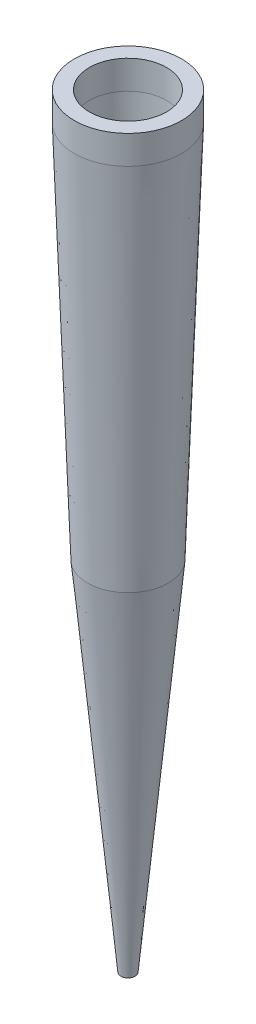
ISO-10303-21;
HEADER;
FILE_DESCRIPTION(('STEP AP214'),'2;1');
FILE_NAME('part.step','',(''),(''),'','','');
FILE_SCHEMA(('AUTOMOTIVE_DESIGN { 1 0 10303 214 1 1 1 1 }'));
ENDSEC;
DATA;
#1=APPLICATION_CONTEXT('core data for automotive mechanical design processes');
#2=APPLICATION_PROTOCOL_DEFINITION('international standard','automotive_design',2000,#1);
#3=PRODUCT_CONTEXT('',#1,'mechanical');
#4=PRODUCT('Part','Part','',(#3));
#5=PRODUCT_RELATED_PRODUCT_CATEGORY('part','',(#4));
#6=PRODUCT_DEFINITION_FORMATION('','',#4);
#7=PRODUCT_DEFINITION_CONTEXT('part definition',#1,'design');
#8=PRODUCT_DEFINITION('design','',#6,#7);
#9=PRODUCT_DEFINITION_SHAPE('','',#8);
#10=(LENGTH_UNIT() NAMED_UNIT(*) SI_UNIT(.MILLI.,.METRE.));
#11=(NAMED_UNIT(*) PLANE_ANGLE_UNIT() SI_UNIT($,.RADIAN.));
#12=(NAMED_UNIT(*) SI_UNIT($,.STERADIAN.) SOLID_ANGLE_UNIT());
#13=UNCERTAINTY_MEASURE_WITH_UNIT(LENGTH_MEASURE(1.E-05),#10,'distance_accuracy_value','');
#14=(GEOMETRIC_REPRESENTATION_CONTEXT(3) GLOBAL_UNCERTAINTY_ASSIGNED_CONTEXT((#13)) GLOBAL_UNIT_ASSIGNED_CONTEXT((#10,
#11,#12)) REPRESENTATION_CONTEXT('',''));
#15=CARTESIAN_POINT('',(0.,0.,0.));
#16=DIRECTION('',(0.,0.,1.));
#17=DIRECTION('',(1.,0.,0.));
#18=AXIS2_PLACEMENT_3D('',#15,#16,#17);
#19=CARTESIAN_POINT('',(-3.75,0.,0.));
#20=DIRECTION('',(0.,1.,0.));
#21=DIRECTION('',(-1.,0.,0.));
#22=AXIS2_PLACEMENT_3D('',#19,#20,#21);
#23=PLANE('',#22);
#24=CARTESIAN_POINT('',(0.,0.,0.));
#25=DIRECTION('',(0.,1.,0.));
#26=DIRECTION('',(-1.,0.,0.));
#27=AXIS2_PLACEMENT_3D('',#24,#25,#26);
#28=CIRCLE('',#27,3.75);
#29=CARTESIAN_POINT('',(-3.75,0.,0.));
#30=VERTEX_POINT('',#29);
#31=EDGE_CURVE('E64',#30,#30,#28,.T.);
#32=ORIENTED_EDGE('',*,*,#31,.T.);
#33=EDGE_LOOP('',(#32));
#34=FACE_BOUND('',#33,.T.);
#35=CARTESIAN_POINT('',(0.,0.,0.));
#36=DIRECTION('',(0.,1.,0.));
#37=DIRECTION('',(-1.,0.,0.));
#38=AXIS2_PLACEMENT_3D('',#35,#36,#37);
#39=CIRCLE('',#38,2.7);
#40=CARTESIAN_POINT('',(-2.7,0.,0.));
#41=VERTEX_POINT('',#40);
#42=EDGE_CURVE('E10',#41,#41,#39,.T.);
#43=ORIENTED_EDGE('',*,*,#42,.F.);
#44=EDGE_LOOP('',(#43));
#45=FACE_BOUND('',#44,.T.);
#46=ADVANCED_FACE('F35',(#34,#45),#23,.T.);
#47=CARTESIAN_POINT('',(0.,0.,0.));
#48=DIRECTION('',(0.,1.,0.));
#49=DIRECTION('',(-1.,0.,0.));
#50=AXIS2_PLACEMENT_3D('',#47,#48,#49);
#51=CYLINDRICAL_SURFACE('',#50,2.7);
#52=ORIENTED_EDGE('',*,*,#42,.T.);
#53=EDGE_LOOP('',(#52));
#54=FACE_BOUND('',#53,.T.);
#55=CARTESIAN_POINT('',(0.,-2.,0.));
#56=DIRECTION('',(0.,1.,0.));
#57=DIRECTION('',(-1.,0.,0.));
#58=AXIS2_PLACEMENT_3D('',#55,#56,#57);
#59=CIRCLE('',#58,2.7);
#60=CARTESIAN_POINT('',(-2.7,-2.,0.));
#61=VERTEX_POINT('',#60);
#62=EDGE_CURVE('E42',#61,#61,#59,.T.);
#63=ORIENTED_EDGE('',*,*,#62,.F.);
#64=EDGE_LOOP('',(#63));
#65=FACE_BOUND('',#64,.T.);
#66=ADVANCED_FACE('F82',(#54,#65),#51,.F.);
#67=CARTESIAN_POINT('',(0.,-28.5,0.));
#68=DIRECTION('',(0.,1.,0.));
#69=DIRECTION('',(-1.,0.,0.));
#70=AXIS2_PLACEMENT_3D('',#67,#68,#69);
#71=CONICAL_SURFACE('',#70,1.77459960846869,0.0349065850398864);
#72=ORIENTED_EDGE('',*,*,#62,.T.);
#73=EDGE_LOOP('',(#72));
#74=FACE_BOUND('',#73,.T.);
#75=CARTESIAN_POINT('',(0.,-28.5,0.));
#76=DIRECTION('',(0.,1.,0.));
#77=DIRECTION('',(-1.,0.,0.));
#78=AXIS2_PLACEMENT_3D('',#75,#76,#77);
#79=CIRCLE('',#78,1.77459960846869);
#80=CARTESIAN_POINT('',(-1.77459960846869,-28.5,0.));
#81=VERTEX_POINT('',#80);
#82=EDGE_CURVE('E49',#81,#81,#79,.T.);
#83=ORIENTED_EDGE('',*,*,#82,.F.);
#84=EDGE_LOOP('',(#83));
#85=FACE_BOUND('',#84,.T.);
#86=ADVANCED_FACE('F86',(#74,#85),#71,.F.);
#87=CARTESIAN_POINT('',(0.,-53.5,0.));
#88=DIRECTION('',(0.,1.,0.));
#89=DIRECTION('',(-1.,0.,0.));
#90=AXIS2_PLACEMENT_3D('',#87,#88,#89);
#91=CONICAL_SURFACE('',#90,0.5,0.0509398777515094);
#92=ORIENTED_EDGE('',*,*,#82,.T.);
#93=EDGE_LOOP('',(#92));
#94=FACE_BOUND('',#93,.T.);
#95=CARTESIAN_POINT('',(0.,-53.5,0.));
#96=DIRECTION('',(0.,1.,0.));
#97=DIRECTION('',(-1.,0.,0.));
#98=AXIS2_PLACEMENT_3D('',#95,#96,#97);
#99=CIRCLE('',#98,0.5);
#100=CARTESIAN_POINT('',(-0.499999999999994,-53.5,0.));
#101=VERTEX_POINT('',#100);
#102=EDGE_CURVE('E53',#101,#101,#99,.T.);
#103=ORIENTED_EDGE('',*,*,#102,.F.);
#104=EDGE_LOOP('',(#103));
#105=FACE_BOUND('',#104,.T.);
#106=ADVANCED_FACE('F90',(#94,#105),#91,.F.);
#107=CARTESIAN_POINT('',(0.,-28.5,0.));
#108=DIRECTION('',(0.,1.,0.));
#109=DIRECTION('',(-1.,0.,0.));
#110=AXIS2_PLACEMENT_3D('',#107,#108,#109);
#111=CONICAL_SURFACE('',#110,2.82459960846869,0.0927173854854034);
#112=ORIENTED_EDGE('',*,*,#102,.T.);
#113=EDGE_LOOP('',(#112));
#114=FACE_BOUND('',#113,.T.);
#115=CARTESIAN_POINT('',(0.,-28.5,0.));
#116=DIRECTION('',(0.,1.,0.));
#117=DIRECTION('',(-1.,0.,0.));
#118=AXIS2_PLACEMENT_3D('',#115,#116,#117);
#119=CIRCLE('',#118,2.82459960846869);
#120=CARTESIAN_POINT('',(-2.82459960846869,-28.5,0.));
#121=VERTEX_POINT('',#120);
#122=EDGE_CURVE('E58',#121,#121,#119,.T.);
#123=ORIENTED_EDGE('',*,*,#122,.F.);
#124=EDGE_LOOP('',(#123));
#125=FACE_BOUND('',#124,.T.);
#126=ADVANCED_FACE('F78',(#114,#125),#111,.T.);
#127=CARTESIAN_POINT('',(0.,-2.,0.));
#128=DIRECTION('',(0.,1.,0.));
#129=DIRECTION('',(-1.,0.,0.));
#130=AXIS2_PLACEMENT_3D('',#127,#128,#129);
#131=CONICAL_SURFACE('',#130,3.75,0.0349065850398863);
#132=ORIENTED_EDGE('',*,*,#122,.T.);
#133=EDGE_LOOP('',(#132));
#134=FACE_BOUND('',#133,.T.);
#135=CARTESIAN_POINT('',(0.,-2.,0.));
#136=DIRECTION('',(0.,1.,0.));
#137=DIRECTION('',(-1.,0.,0.));
#138=AXIS2_PLACEMENT_3D('',#135,#136,#137);
#139=CIRCLE('',#138,3.75);
#140=CARTESIAN_POINT('',(-3.75,-2.,0.));
#141=VERTEX_POINT('',#140);
#142=EDGE_CURVE('E61',#141,#141,#139,.T.);
#143=ORIENTED_EDGE('',*,*,#142,.F.);
#144=EDGE_LOOP('',(#143));
#145=FACE_BOUND('',#144,.T.);
#146=ADVANCED_FACE('F72',(#134,#145),#131,.T.);
#147=CARTESIAN_POINT('',(0.,0.,0.));
#148=DIRECTION('',(0.,1.,0.));
#149=DIRECTION('',(-1.,0.,0.));
#150=AXIS2_PLACEMENT_3D('',#147,#148,#149);
#151=CYLINDRICAL_SURFACE('',#150,3.75);
#152=ORIENTED_EDGE('',*,*,#142,.T.);
#153=EDGE_LOOP('',(#152));
#154=FACE_BOUND('',#153,.T.);
#155=ORIENTED_EDGE('',*,*,#31,.F.);
#156=EDGE_LOOP('',(#155));
#157=FACE_BOUND('',#156,.T.);
#158=ADVANCED_FACE('F70',(#154,#157),#151,.T.);
#159=CLOSED_SHELL('',(#46,#66,#86,#106,#126,#146,#158));
#160=MANIFOLD_SOLID_BREP('B2',#159);
#161=ADVANCED_BREP_SHAPE_REPRESENTATION('',(#18,#160),#14);
#162=SHAPE_DEFINITION_REPRESENTATION(#9,#161);
ENDSEC;
END-ISO-10303-21;
